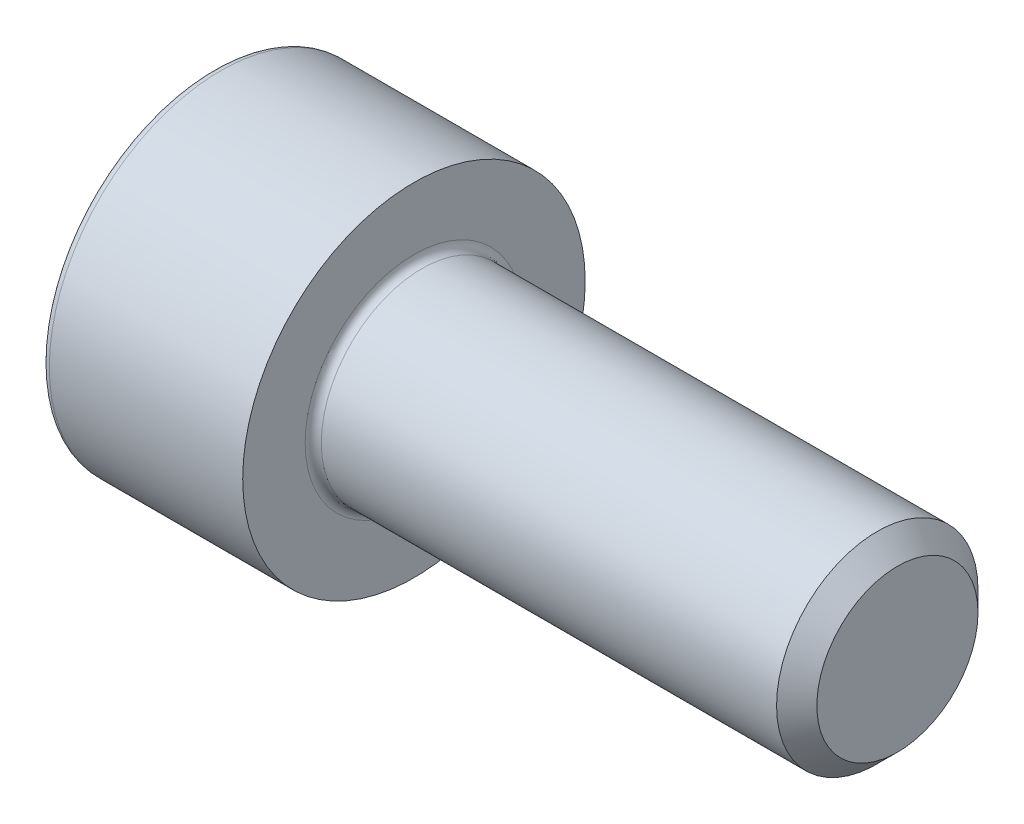
ISO-10303-21;
HEADER;
FILE_DESCRIPTION(('STEP AP214'),'2;1');
FILE_NAME('part.step','',(''),(''),'','','');
FILE_SCHEMA(('AUTOMOTIVE_DESIGN { 1 0 10303 214 1 1 1 1 }'));
ENDSEC;
DATA;
#1=APPLICATION_CONTEXT('core data for automotive mechanical design processes');
#2=APPLICATION_PROTOCOL_DEFINITION('international standard','automotive_design',2000,#1);
#3=PRODUCT_CONTEXT('',#1,'mechanical');
#4=PRODUCT('Part','Part','',(#3));
#5=PRODUCT_RELATED_PRODUCT_CATEGORY('part','',(#4));
#6=PRODUCT_DEFINITION_FORMATION('','',#4);
#7=PRODUCT_DEFINITION_CONTEXT('part definition',#1,'design');
#8=PRODUCT_DEFINITION('design','',#6,#7);
#9=PRODUCT_DEFINITION_SHAPE('','',#8);
#10=(LENGTH_UNIT() NAMED_UNIT(*) SI_UNIT(.MILLI.,.METRE.));
#11=(NAMED_UNIT(*) PLANE_ANGLE_UNIT() SI_UNIT($,.RADIAN.));
#12=(NAMED_UNIT(*) SI_UNIT($,.STERADIAN.) SOLID_ANGLE_UNIT());
#13=UNCERTAINTY_MEASURE_WITH_UNIT(LENGTH_MEASURE(1.E-05),#10,'distance_accuracy_value','');
#14=(GEOMETRIC_REPRESENTATION_CONTEXT(3) GLOBAL_UNCERTAINTY_ASSIGNED_CONTEXT((#13)) GLOBAL_UNIT_ASSIGNED_CONTEXT((#10,
#11,#12)) REPRESENTATION_CONTEXT('',''));
#15=CARTESIAN_POINT('',(0.,0.,0.));
#16=DIRECTION('',(0.,0.,1.));
#17=DIRECTION('',(1.,0.,0.));
#18=AXIS2_PLACEMENT_3D('',#15,#16,#17);
#19=CARTESIAN_POINT('',(0.,0.,0.));
#20=DIRECTION('',(1.,0.,0.));
#21=DIRECTION('',(0.,0.,-1.));
#22=AXIS2_PLACEMENT_3D('',#19,#20,#21);
#23=CYLINDRICAL_SURFACE('',#22,2.5);
#24=CARTESIAN_POINT('',(16.5,0.,0.));
#25=DIRECTION('',(1.,0.,0.));
#26=DIRECTION('',(0.,0.,-1.));
#27=AXIS2_PLACEMENT_3D('',#24,#25,#26);
#28=CIRCLE('',#27,2.5);
#29=CARTESIAN_POINT('',(16.5,0.,-2.5));
#30=VERTEX_POINT('',#29);
#31=EDGE_CURVE('E11',#30,#30,#28,.F.);
#32=ORIENTED_EDGE('',*,*,#31,.T.);
#33=EDGE_LOOP('',(#32));
#34=FACE_BOUND('',#33,.T.);
#35=CARTESIAN_POINT('',(5.2,0.,0.));
#36=DIRECTION('',(1.,0.,0.));
#37=DIRECTION('',(0.,0.,-1.));
#38=AXIS2_PLACEMENT_3D('',#35,#36,#37);
#39=CIRCLE('',#38,2.5);
#40=CARTESIAN_POINT('',(5.2,0.,-2.5));
#41=VERTEX_POINT('',#40);
#42=EDGE_CURVE('E171',#41,#41,#39,.T.);
#43=ORIENTED_EDGE('',*,*,#42,.T.);
#44=EDGE_LOOP('',(#43));
#45=FACE_BOUND('',#44,.T.);
#46=ADVANCED_FACE('F42',(#34,#45),#23,.T.);
#47=CARTESIAN_POINT('',(2.5,-1.145,1.98319817466636));
#48=DIRECTION('',(-1.,0.,0.));
#49=DIRECTION('',(0.,0.,1.));
#50=AXIS2_PLACEMENT_3D('',#47,#48,#49);
#51=PLANE('',#50);
#52=DIRECTION('',(0.,1.,0.));
#53=VECTOR('',#52,1.);
#54=CARTESIAN_POINT('',(2.5,1.145,-1.98319817466636));
#55=LINE('',#54,#53);
#56=CARTESIAN_POINT('',(2.5,1.145,-1.98319817466636));
#57=VERTEX_POINT('',#56);
#58=CARTESIAN_POINT('',(2.5,-1.145,-1.98319817466636));
#59=VERTEX_POINT('',#58);
#60=EDGE_CURVE('E105',#57,#59,#55,.F.);
#61=ORIENTED_EDGE('',*,*,#60,.T.);
#62=DIRECTION('',(0.,0.5,-0.866025403784439));
#63=VECTOR('',#62,1.);
#64=CARTESIAN_POINT('',(2.5,-1.145,-1.98319817466636));
#65=LINE('',#64,#63);
#66=CARTESIAN_POINT('',(2.5,-2.29,0.));
#67=VERTEX_POINT('',#66);
#68=EDGE_CURVE('E107',#59,#67,#65,.F.);
#69=ORIENTED_EDGE('',*,*,#68,.T.);
#70=DIRECTION('',(0.,-0.5,-0.866025403784439));
#71=VECTOR('',#70,1.);
#72=CARTESIAN_POINT('',(2.5,-2.29,0.));
#73=LINE('',#72,#71);
#74=CARTESIAN_POINT('',(2.5,-1.145,1.98319817466636));
#75=VERTEX_POINT('',#74);
#76=EDGE_CURVE('E110',#67,#75,#73,.F.);
#77=ORIENTED_EDGE('',*,*,#76,.T.);
#78=DIRECTION('',(0.,-1.,0.));
#79=VECTOR('',#78,1.);
#80=CARTESIAN_POINT('',(2.5,-1.145,1.98319817466636));
#81=LINE('',#80,#79);
#82=CARTESIAN_POINT('',(2.5,1.145,1.98319817466636));
#83=VERTEX_POINT('',#82);
#84=EDGE_CURVE('E266',#75,#83,#81,.F.);
#85=ORIENTED_EDGE('',*,*,#84,.T.);
#86=DIRECTION('',(0.,-0.5,0.866025403784439));
#87=VECTOR('',#86,1.);
#88=CARTESIAN_POINT('',(2.5,1.145,1.98319817466636));
#89=LINE('',#88,#87);
#90=CARTESIAN_POINT('',(2.5,2.29,0.));
#91=VERTEX_POINT('',#90);
#92=EDGE_CURVE('E273',#83,#91,#89,.F.);
#93=ORIENTED_EDGE('',*,*,#92,.T.);
#94=DIRECTION('',(0.,0.5,0.866025403784439));
#95=VECTOR('',#94,1.);
#96=CARTESIAN_POINT('',(2.5,2.29,0.));
#97=LINE('',#96,#95);
#98=EDGE_CURVE('E279',#91,#57,#97,.F.);
#99=ORIENTED_EDGE('',*,*,#98,.T.);
#100=EDGE_LOOP('',(#61,#69,#77,#85,#93,#99));
#101=FACE_BOUND('',#100,.T.);
#102=ADVANCED_FACE('F109',(#101),#51,.T.);
#103=CARTESIAN_POINT('',(2.5,-2.29,0.));
#104=DIRECTION('',(0.,-0.866025403784439,0.5));
#105=DIRECTION('',(0.,-0.5,-0.866025403784439));
#106=AXIS2_PLACEMENT_3D('',#103,#104,#105);
#107=PLANE('',#106);
#108=DIRECTION('',(1.,0.,0.));
#109=VECTOR('',#108,1.);
#110=CARTESIAN_POINT('',(2.5,-1.145,1.98319817466636));
#111=LINE('',#110,#109);
#112=CARTESIAN_POINT('',(0.,-1.145,1.98319817466636));
#113=VERTEX_POINT('',#112);
#114=EDGE_CURVE('E122',#113,#75,#111,.T.);
#115=ORIENTED_EDGE('',*,*,#114,.T.);
#116=ORIENTED_EDGE('',*,*,#76,.F.);
#117=DIRECTION('',(1.,0.,0.));
#118=VECTOR('',#117,1.);
#119=CARTESIAN_POINT('',(2.5,-2.29,0.));
#120=LINE('',#119,#118);
#121=CARTESIAN_POINT('',(0.,-2.29,0.));
#122=VERTEX_POINT('',#121);
#123=EDGE_CURVE('E116',#67,#122,#120,.F.);
#124=ORIENTED_EDGE('',*,*,#123,.T.);
#125=DIRECTION('',(0.,-0.5,-0.866025403784439));
#126=VECTOR('',#125,1.);
#127=CARTESIAN_POINT('',(0.,-1.145,1.98319817466636));
#128=LINE('',#127,#126);
#129=EDGE_CURVE('E260',#113,#122,#128,.T.);
#130=ORIENTED_EDGE('',*,*,#129,.F.);
#131=EDGE_LOOP('',(#115,#116,#124,#130));
#132=FACE_BOUND('',#131,.T.);
#133=ADVANCED_FACE('F119',(#132),#107,.F.);
#134=CARTESIAN_POINT('',(2.5,-1.145,-1.98319817466636));
#135=DIRECTION('',(0.,-0.866025403784439,-0.5));
#136=DIRECTION('',(0.,0.5,-0.866025403784439));
#137=AXIS2_PLACEMENT_3D('',#134,#135,#136);
#138=PLANE('',#137);
#139=ORIENTED_EDGE('',*,*,#123,.F.);
#140=ORIENTED_EDGE('',*,*,#68,.F.);
#141=DIRECTION('',(1.,0.,0.));
#142=VECTOR('',#141,1.);
#143=CARTESIAN_POINT('',(2.5,-1.145,-1.98319817466636));
#144=LINE('',#143,#142);
#145=CARTESIAN_POINT('',(0.,-1.145,-1.98319817466636));
#146=VERTEX_POINT('',#145);
#147=EDGE_CURVE('E133',#59,#146,#144,.F.);
#148=ORIENTED_EDGE('',*,*,#147,.T.);
#149=DIRECTION('',(0.,0.5,-0.866025403784439));
#150=VECTOR('',#149,1.);
#151=CARTESIAN_POINT('',(0.,-2.29,0.));
#152=LINE('',#151,#150);
#153=EDGE_CURVE('E128',#122,#146,#152,.T.);
#154=ORIENTED_EDGE('',*,*,#153,.F.);
#155=EDGE_LOOP('',(#139,#140,#148,#154));
#156=FACE_BOUND('',#155,.T.);
#157=ADVANCED_FACE('F126',(#156),#138,.F.);
#158=CARTESIAN_POINT('',(2.5,1.145,-1.98319817466636));
#159=DIRECTION('',(0.,0.,-1.));
#160=DIRECTION('',(0.,1.,0.));
#161=AXIS2_PLACEMENT_3D('',#158,#159,#160);
#162=PLANE('',#161);
#163=ORIENTED_EDGE('',*,*,#147,.F.);
#164=ORIENTED_EDGE('',*,*,#60,.F.);
#165=DIRECTION('',(1.,0.,0.));
#166=VECTOR('',#165,1.);
#167=CARTESIAN_POINT('',(2.5,1.145,-1.98319817466636));
#168=LINE('',#167,#166);
#169=CARTESIAN_POINT('',(0.,1.145,-1.98319817466636));
#170=VERTEX_POINT('',#169);
#171=EDGE_CURVE('E276',#57,#170,#168,.F.);
#172=ORIENTED_EDGE('',*,*,#171,.T.);
#173=DIRECTION('',(0.,1.,0.));
#174=VECTOR('',#173,1.);
#175=CARTESIAN_POINT('',(0.,0.,-1.98319817466636));
#176=LINE('',#175,#174);
#177=EDGE_CURVE('E254',#146,#170,#176,.T.);
#178=ORIENTED_EDGE('',*,*,#177,.F.);
#179=EDGE_LOOP('',(#163,#164,#172,#178));
#180=FACE_BOUND('',#179,.T.);
#181=ADVANCED_FACE('F285',(#180),#162,.F.);
#182=CARTESIAN_POINT('',(2.5,2.29,0.));
#183=DIRECTION('',(0.,0.866025403784439,-0.5));
#184=DIRECTION('',(0.,0.5,0.866025403784439));
#185=AXIS2_PLACEMENT_3D('',#182,#183,#184);
#186=PLANE('',#185);
#187=ORIENTED_EDGE('',*,*,#171,.F.);
#188=ORIENTED_EDGE('',*,*,#98,.F.);
#189=DIRECTION('',(1.,0.,0.));
#190=VECTOR('',#189,1.);
#191=CARTESIAN_POINT('',(2.5,2.29,0.));
#192=LINE('',#191,#190);
#193=CARTESIAN_POINT('',(0.,2.29,0.));
#194=VERTEX_POINT('',#193);
#195=EDGE_CURVE('E270',#91,#194,#192,.F.);
#196=ORIENTED_EDGE('',*,*,#195,.T.);
#197=DIRECTION('',(0.,0.5,0.866025403784439));
#198=VECTOR('',#197,1.);
#199=CARTESIAN_POINT('',(0.,1.145,-1.98319817466636));
#200=LINE('',#199,#198);
#201=EDGE_CURVE('E250',#170,#194,#200,.T.);
#202=ORIENTED_EDGE('',*,*,#201,.F.);
#203=EDGE_LOOP('',(#187,#188,#196,#202));
#204=FACE_BOUND('',#203,.T.);
#205=ADVANCED_FACE('F301',(#204),#186,.F.);
#206=CARTESIAN_POINT('',(2.5,1.145,1.98319817466636));
#207=DIRECTION('',(0.,0.866025403784439,0.5));
#208=DIRECTION('',(0.,-0.5,0.866025403784439));
#209=AXIS2_PLACEMENT_3D('',#206,#207,#208);
#210=PLANE('',#209);
#211=ORIENTED_EDGE('',*,*,#195,.F.);
#212=ORIENTED_EDGE('',*,*,#92,.F.);
#213=DIRECTION('',(1.,0.,0.));
#214=VECTOR('',#213,1.);
#215=CARTESIAN_POINT('',(2.5,1.145,1.98319817466636));
#216=LINE('',#215,#214);
#217=CARTESIAN_POINT('',(0.,1.145,1.98319817466636));
#218=VERTEX_POINT('',#217);
#219=EDGE_CURVE('E263',#83,#218,#216,.F.);
#220=ORIENTED_EDGE('',*,*,#219,.T.);
#221=DIRECTION('',(0.,-0.5,0.866025403784439));
#222=VECTOR('',#221,1.);
#223=CARTESIAN_POINT('',(0.,2.29,0.));
#224=LINE('',#223,#222);
#225=EDGE_CURVE('E246',#194,#218,#224,.T.);
#226=ORIENTED_EDGE('',*,*,#225,.F.);
#227=EDGE_LOOP('',(#211,#212,#220,#226));
#228=FACE_BOUND('',#227,.T.);
#229=ADVANCED_FACE('F298',(#228),#210,.F.);
#230=CARTESIAN_POINT('',(2.5,-1.145,1.98319817466636));
#231=DIRECTION('',(0.,0.,1.));
#232=DIRECTION('',(0.,-1.,0.));
#233=AXIS2_PLACEMENT_3D('',#230,#231,#232);
#234=PLANE('',#233);
#235=ORIENTED_EDGE('',*,*,#219,.F.);
#236=ORIENTED_EDGE('',*,*,#84,.F.);
#237=ORIENTED_EDGE('',*,*,#114,.F.);
#238=DIRECTION('',(0.,1.,0.));
#239=VECTOR('',#238,1.);
#240=CARTESIAN_POINT('',(0.,0.,1.98319817466636));
#241=LINE('',#240,#239);
#242=EDGE_CURVE('E243',#218,#113,#241,.F.);
#243=ORIENTED_EDGE('',*,*,#242,.F.);
#244=EDGE_LOOP('',(#235,#236,#237,#243));
#245=FACE_BOUND('',#244,.T.);
#246=ADVANCED_FACE('F293',(#245),#234,.F.);
#247=CARTESIAN_POINT('',(0.,0.,0.));
#248=DIRECTION('',(-1.,0.,0.));
#249=DIRECTION('',(0.,0.,1.));
#250=AXIS2_PLACEMENT_3D('',#247,#248,#249);
#251=PLANE('',#250);
#252=ORIENTED_EDGE('',*,*,#225,.T.);
#253=ORIENTED_EDGE('',*,*,#242,.T.);
#254=ORIENTED_EDGE('',*,*,#129,.T.);
#255=ORIENTED_EDGE('',*,*,#153,.T.);
#256=ORIENTED_EDGE('',*,*,#177,.T.);
#257=ORIENTED_EDGE('',*,*,#201,.T.);
#258=EDGE_LOOP('',(#252,#253,#254,#255,#256,#257));
#259=FACE_BOUND('',#258,.T.);
#260=CARTESIAN_POINT('',(0.,0.,0.));
#261=DIRECTION('',(1.,0.,0.));
#262=DIRECTION('',(0.,0.,-1.));
#263=AXIS2_PLACEMENT_3D('',#260,#261,#262);
#264=CIRCLE('',#263,4.05);
#265=CARTESIAN_POINT('',(0.,0.,-4.05));
#266=VERTEX_POINT('',#265);
#267=CARTESIAN_POINT('',(0.,0.,4.05));
#268=VERTEX_POINT('',#267);
#269=EDGE_CURVE('E241',#266,#268,#264,.T.);
#270=ORIENTED_EDGE('',*,*,#269,.F.);
#271=CARTESIAN_POINT('',(0.,0.,0.));
#272=DIRECTION('',(1.,0.,0.));
#273=DIRECTION('',(0.,0.,1.));
#274=AXIS2_PLACEMENT_3D('',#271,#272,#273);
#275=CIRCLE('',#274,4.05);
#276=EDGE_CURVE('E201',#268,#266,#275,.T.);
#277=ORIENTED_EDGE('',*,*,#276,.F.);
#278=EDGE_LOOP('',(#270,#277));
#279=FACE_BOUND('',#278,.T.);
#280=ADVANCED_FACE('F211',(#259,#279),#251,.T.);
#281=CARTESIAN_POINT('',(0.2,0.,0.));
#282=DIRECTION('',(-1.,0.,0.));
#283=DIRECTION('',(0.,0.,1.));
#284=AXIS2_PLACEMENT_3D('',#281,#282,#283);
#285=TOROIDAL_SURFACE('',#284,4.05,0.2);
#286=CARTESIAN_POINT('',(0.2,0.,0.));
#287=DIRECTION('',(1.,0.,0.));
#288=DIRECTION('',(0.,0.,-1.));
#289=AXIS2_PLACEMENT_3D('',#286,#287,#288);
#290=CIRCLE('',#289,4.25);
#291=CARTESIAN_POINT('',(0.2,0.,-4.25));
#292=VERTEX_POINT('',#291);
#293=EDGE_CURVE('E142',#292,#292,#290,.T.);
#294=ORIENTED_EDGE('',*,*,#293,.F.);
#295=EDGE_LOOP('',(#294));
#296=FACE_BOUND('',#295,.T.);
#297=ORIENTED_EDGE('',*,*,#276,.T.);
#298=ORIENTED_EDGE('',*,*,#269,.T.);
#299=EDGE_LOOP('',(#297,#298));
#300=FACE_BOUND('',#299,.T.);
#301=ADVANCED_FACE('F206',(#296,#300),#285,.T.);
#302=CARTESIAN_POINT('',(0.,0.,0.));
#303=DIRECTION('',(1.,0.,0.));
#304=DIRECTION('',(0.,0.,-1.));
#305=AXIS2_PLACEMENT_3D('',#302,#303,#304);
#306=CYLINDRICAL_SURFACE('',#305,4.25);
#307=ORIENTED_EDGE('',*,*,#293,.T.);
#308=EDGE_LOOP('',(#307));
#309=FACE_BOUND('',#308,.T.);
#310=CARTESIAN_POINT('',(5.,0.,0.));
#311=DIRECTION('',(1.,0.,0.));
#312=DIRECTION('',(0.,0.,-1.));
#313=AXIS2_PLACEMENT_3D('',#310,#311,#312);
#314=CIRCLE('',#313,4.25);
#315=CARTESIAN_POINT('',(5.,0.,-4.25));
#316=VERTEX_POINT('',#315);
#317=EDGE_CURVE('E137',#316,#316,#314,.T.);
#318=ORIENTED_EDGE('',*,*,#317,.F.);
#319=EDGE_LOOP('',(#318));
#320=FACE_BOUND('',#319,.T.);
#321=ADVANCED_FACE('F210',(#309,#320),#306,.T.);
#322=CARTESIAN_POINT('',(5.,4.25,0.));
#323=DIRECTION('',(1.,0.,0.));
#324=DIRECTION('',(0.,0.,-1.));
#325=AXIS2_PLACEMENT_3D('',#322,#323,#324);
#326=PLANE('',#325);
#327=CARTESIAN_POINT('',(5.,0.,0.));
#328=DIRECTION('',(1.,0.,0.));
#329=DIRECTION('',(0.,0.,-1.));
#330=AXIS2_PLACEMENT_3D('',#327,#328,#329);
#331=CIRCLE('',#330,2.7);
#332=CARTESIAN_POINT('',(5.,0.,2.7));
#333=VERTEX_POINT('',#332);
#334=CARTESIAN_POINT('',(5.,0.,-2.7));
#335=VERTEX_POINT('',#334);
#336=EDGE_CURVE('E60',#333,#335,#331,.F.);
#337=ORIENTED_EDGE('',*,*,#336,.T.);
#338=CARTESIAN_POINT('',(5.,0.,0.));
#339=DIRECTION('',(1.,0.,0.));
#340=DIRECTION('',(0.,0.,1.));
#341=AXIS2_PLACEMENT_3D('',#338,#339,#340);
#342=CIRCLE('',#341,2.7);
#343=EDGE_CURVE('E141',#335,#333,#342,.F.);
#344=ORIENTED_EDGE('',*,*,#343,.T.);
#345=EDGE_LOOP('',(#337,#344));
#346=FACE_BOUND('',#345,.T.);
#347=ORIENTED_EDGE('',*,*,#317,.T.);
#348=EDGE_LOOP('',(#347));
#349=FACE_BOUND('',#348,.T.);
#350=ADVANCED_FACE('F162',(#346,#349),#326,.T.);
#351=CARTESIAN_POINT('',(5.2,0.,0.));
#352=DIRECTION('',(1.,0.,0.));
#353=DIRECTION('',(0.,0.,-1.));
#354=AXIS2_PLACEMENT_3D('',#351,#352,#353);
#355=TOROIDAL_SURFACE('',#354,2.7,0.2);
#356=ORIENTED_EDGE('',*,*,#42,.F.);
#357=EDGE_LOOP('',(#356));
#358=FACE_BOUND('',#357,.T.);
#359=ORIENTED_EDGE('',*,*,#343,.F.);
#360=ORIENTED_EDGE('',*,*,#336,.F.);
#361=EDGE_LOOP('',(#359,#360));
#362=FACE_BOUND('',#361,.T.);
#363=ADVANCED_FACE('F150',(#358,#362),#355,.F.);
#364=CARTESIAN_POINT('',(17.,0.,0.));
#365=DIRECTION('',(1.,0.,0.));
#366=DIRECTION('',(0.,0.,-1.));
#367=AXIS2_PLACEMENT_3D('',#364,#365,#366);
#368=PLANE('',#367);
#369=CARTESIAN_POINT('',(17.,0.,0.));
#370=DIRECTION('',(1.,0.,0.));
#371=DIRECTION('',(0.,0.,-1.));
#372=AXIS2_PLACEMENT_3D('',#369,#370,#371);
#373=CIRCLE('',#372,2.);
#374=CARTESIAN_POINT('',(17.,0.,-2.));
#375=VERTEX_POINT('',#374);
#376=EDGE_CURVE('E53',#375,#375,#373,.T.);
#377=ORIENTED_EDGE('',*,*,#376,.T.);
#378=EDGE_LOOP('',(#377));
#379=FACE_BOUND('',#378,.T.);
#380=ADVANCED_FACE('F161',(#379),#368,.T.);
#381=CARTESIAN_POINT('',(17.,0.,0.));
#382=DIRECTION('',(-1.,0.,0.));
#383=DIRECTION('',(0.,0.,1.));
#384=AXIS2_PLACEMENT_3D('',#381,#382,#383);
#385=CONICAL_SURFACE('',#384,2.,0.785398163397447);
#386=ORIENTED_EDGE('',*,*,#31,.F.);
#387=EDGE_LOOP('',(#386));
#388=FACE_BOUND('',#387,.T.);
#389=ORIENTED_EDGE('',*,*,#376,.F.);
#390=EDGE_LOOP('',(#389));
#391=FACE_BOUND('',#390,.T.);
#392=ADVANCED_FACE('F45',(#388,#391),#385,.T.);
#393=CLOSED_SHELL('',(#46,#102,#133,#157,#181,#205,#229,#246,#280,#301,#321,#350,#363,#380,#392));
#394=MANIFOLD_SOLID_BREP('B2',#393);
#395=ADVANCED_BREP_SHAPE_REPRESENTATION('',(#18,#394),#14);
#396=SHAPE_DEFINITION_REPRESENTATION(#9,#395);
ENDSEC;
END-ISO-10303-21;
